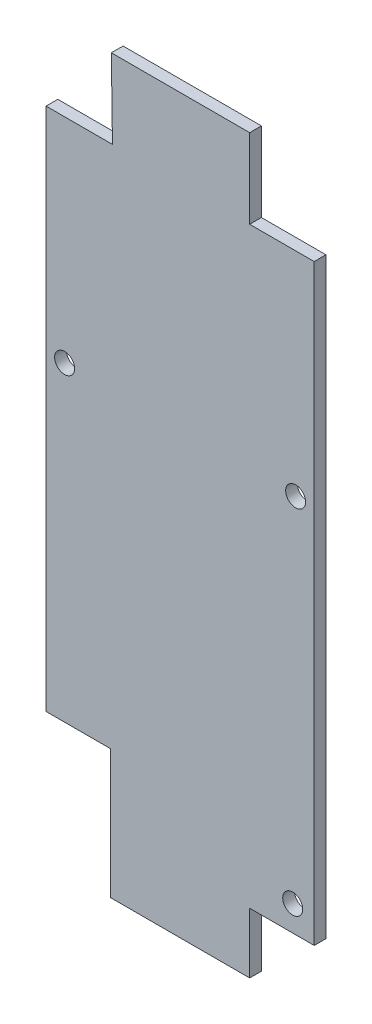
ISO-10303-21;
HEADER;
FILE_DESCRIPTION(('STEP AP214'),'2;1');
FILE_NAME('part.step','',(''),(''),'','','');
FILE_SCHEMA(('AUTOMOTIVE_DESIGN { 1 0 10303 214 1 1 1 1 }'));
ENDSEC;
DATA;
#1=APPLICATION_CONTEXT('core data for automotive mechanical design processes');
#2=APPLICATION_PROTOCOL_DEFINITION('international standard','automotive_design',2000,#1);
#3=PRODUCT_CONTEXT('',#1,'mechanical');
#4=PRODUCT('Part','Part','',(#3));
#5=PRODUCT_RELATED_PRODUCT_CATEGORY('part','',(#4));
#6=PRODUCT_DEFINITION_FORMATION('','',#4);
#7=PRODUCT_DEFINITION_CONTEXT('part definition',#1,'design');
#8=PRODUCT_DEFINITION('design','',#6,#7);
#9=PRODUCT_DEFINITION_SHAPE('','',#8);
#10=(LENGTH_UNIT() NAMED_UNIT(*) SI_UNIT(.MILLI.,.METRE.));
#11=(NAMED_UNIT(*) PLANE_ANGLE_UNIT() SI_UNIT($,.RADIAN.));
#12=(NAMED_UNIT(*) SI_UNIT($,.STERADIAN.) SOLID_ANGLE_UNIT());
#13=UNCERTAINTY_MEASURE_WITH_UNIT(LENGTH_MEASURE(1.E-05),#10,'distance_accuracy_value','');
#14=(GEOMETRIC_REPRESENTATION_CONTEXT(3) GLOBAL_UNCERTAINTY_ASSIGNED_CONTEXT((#13)) GLOBAL_UNIT_ASSIGNED_CONTEXT((#10,
#11,#12)) REPRESENTATION_CONTEXT('',''));
#15=CARTESIAN_POINT('',(0.,0.,0.));
#16=DIRECTION('',(0.,0.,1.));
#17=DIRECTION('',(1.,0.,0.));
#18=AXIS2_PLACEMENT_3D('',#15,#16,#17);
#19=CARTESIAN_POINT('',(5.44830000000197,-27.4129499999973,1.58750000000001));
#20=DIRECTION('',(0.,-1.,0.));
#21=DIRECTION('',(0.,0.,-1.));
#22=AXIS2_PLACEMENT_3D('',#19,#20,#21);
#23=PLANE('',#22);
#24=DIRECTION('',(-1.,0.,0.));
#25=VECTOR('',#24,1.);
#26=CARTESIAN_POINT('',(5.44830000000197,-27.4129499999973,0.));
#27=LINE('',#26,#25);
#28=CARTESIAN_POINT('',(5.44830000000197,-27.4129499999973,0.));
#29=VERTEX_POINT('',#28);
#30=CARTESIAN_POINT('',(-3.28295000000341,-27.4129499999973,0.));
#31=VERTEX_POINT('',#30);
#32=EDGE_CURVE('E130',#29,#31,#27,.T.);
#33=ORIENTED_EDGE('',*,*,#32,.T.);
#34=DIRECTION('',(0.,0.,-1.));
#35=VECTOR('',#34,1.);
#36=CARTESIAN_POINT('',(-3.28295000000341,-27.4129499999973,1.58749999999998));
#37=LINE('',#36,#35);
#38=CARTESIAN_POINT('',(-3.28295000000341,-27.4129499999973,1.58749999999998));
#39=VERTEX_POINT('',#38);
#40=EDGE_CURVE('E11',#39,#31,#37,.T.);
#41=ORIENTED_EDGE('',*,*,#40,.F.);
#42=DIRECTION('',(-1.,0.,0.));
#43=VECTOR('',#42,1.);
#44=CARTESIAN_POINT('',(5.44830000000197,-27.4129499999973,1.58750000000001));
#45=LINE('',#44,#43);
#46=CARTESIAN_POINT('',(5.44830000000197,-27.4129499999973,1.58750000000001));
#47=VERTEX_POINT('',#46);
#48=EDGE_CURVE('E134',#47,#39,#45,.T.);
#49=ORIENTED_EDGE('',*,*,#48,.F.);
#50=DIRECTION('',(0.,0.,-1.));
#51=VECTOR('',#50,1.);
#52=CARTESIAN_POINT('',(5.44830000000197,-27.4129499999973,1.58750000000001));
#53=LINE('',#52,#51);
#54=EDGE_CURVE('E174',#47,#29,#53,.T.);
#55=ORIENTED_EDGE('',*,*,#54,.T.);
#56=EDGE_LOOP('',(#33,#41,#49,#55));
#57=FACE_BOUND('',#56,.T.);
#58=ADVANCED_FACE('F36',(#57),#23,.F.);
#59=CARTESIAN_POINT('',(-3.28295000000341,-27.4129499999973,1.58749999999998));
#60=DIRECTION('',(-1.,0.,0.));
#61=DIRECTION('',(0.,0.,1.));
#62=AXIS2_PLACEMENT_3D('',#59,#60,#61);
#63=PLANE('',#62);
#64=DIRECTION('',(0.,1.,0.));
#65=VECTOR('',#64,1.);
#66=CARTESIAN_POINT('',(-3.28295000000341,-27.4129499999973,0.));
#67=LINE('',#66,#65);
#68=CARTESIAN_POINT('',(-3.28295000000341,-16.6687499999973,0.));
#69=VERTEX_POINT('',#68);
#70=EDGE_CURVE('E176',#31,#69,#67,.T.);
#71=ORIENTED_EDGE('',*,*,#70,.T.);
#72=DIRECTION('',(0.,0.,-1.));
#73=VECTOR('',#72,1.);
#74=CARTESIAN_POINT('',(-3.28295000000341,-16.6687499999973,1.58749999999998));
#75=LINE('',#74,#73);
#76=CARTESIAN_POINT('',(-3.28295000000341,-16.6687499999973,1.58749999999998));
#77=VERTEX_POINT('',#76);
#78=EDGE_CURVE('E43',#77,#69,#75,.T.);
#79=ORIENTED_EDGE('',*,*,#78,.F.);
#80=DIRECTION('',(0.,1.,0.));
#81=VECTOR('',#80,1.);
#82=CARTESIAN_POINT('',(-3.28295000000341,-27.4129499999973,1.58749999999998));
#83=LINE('',#82,#81);
#84=EDGE_CURVE('E155',#39,#77,#83,.T.);
#85=ORIENTED_EDGE('',*,*,#84,.F.);
#86=ORIENTED_EDGE('',*,*,#40,.T.);
#87=EDGE_LOOP('',(#71,#79,#85,#86));
#88=FACE_BOUND('',#87,.T.);
#89=ADVANCED_FACE('F238',(#88),#63,.F.);
#90=CARTESIAN_POINT('',(-3.28295000000341,-16.6687499999973,1.58749999999998));
#91=DIRECTION('',(0.,-1.,0.));
#92=DIRECTION('',(1.,0.,0.));
#93=AXIS2_PLACEMENT_3D('',#90,#91,#92);
#94=PLANE('',#93);
#95=DIRECTION('',(-1.,0.,0.));
#96=VECTOR('',#95,1.);
#97=CARTESIAN_POINT('',(-3.28295000000341,-16.6687499999973,0.));
#98=LINE('',#97,#96);
#99=CARTESIAN_POINT('',(-22.014883705053,-16.6687499999973,0.));
#100=VERTEX_POINT('',#99);
#101=EDGE_CURVE('E178',#69,#100,#98,.T.);
#102=ORIENTED_EDGE('',*,*,#101,.T.);
#103=DIRECTION('',(0.,0.,-1.));
#104=VECTOR('',#103,1.);
#105=CARTESIAN_POINT('',(-22.0148837050529,-16.6687499999973,1.58750000000001));
#106=LINE('',#105,#104);
#107=CARTESIAN_POINT('',(-22.0148837050529,-16.6687499999973,1.58750000000001));
#108=VERTEX_POINT('',#107);
#109=EDGE_CURVE('E212',#108,#100,#106,.T.);
#110=ORIENTED_EDGE('',*,*,#109,.F.);
#111=DIRECTION('',(-1.,0.,0.));
#112=VECTOR('',#111,1.);
#113=CARTESIAN_POINT('',(-3.28295000000341,-16.6687499999973,1.58749999999998));
#114=LINE('',#113,#112);
#115=EDGE_CURVE('E157',#77,#108,#114,.T.);
#116=ORIENTED_EDGE('',*,*,#115,.F.);
#117=ORIENTED_EDGE('',*,*,#78,.T.);
#118=EDGE_LOOP('',(#102,#110,#116,#117));
#119=FACE_BOUND('',#118,.T.);
#120=ADVANCED_FACE('F219',(#119),#94,.F.);
#121=CARTESIAN_POINT('',(-22.0148837050529,-16.6687499999973,1.58750000000001));
#122=DIRECTION('',(0.999897552567853,0.0143137824776339,0.));
#123=DIRECTION('',(-0.0143137824776341,0.999897552567853,0.));
#124=AXIS2_PLACEMENT_3D('',#121,#122,#123);
#125=PLANE('',#124);
#126=DIRECTION('',(0.0143137824776341,-0.999897552567853,0.));
#127=VECTOR('',#126,1.);
#128=CARTESIAN_POINT('',(-22.014883705053,-16.6687499999973,0.));
#129=LINE('',#128,#127);
#130=CARTESIAN_POINT('',(-21.8621686283145,-27.3367499999675,0.));
#131=VERTEX_POINT('',#130);
#132=EDGE_CURVE('E180',#100,#131,#129,.T.);
#133=ORIENTED_EDGE('',*,*,#132,.T.);
#134=DIRECTION('',(0.,0.,-1.));
#135=VECTOR('',#134,1.);
#136=CARTESIAN_POINT('',(-21.8621686283145,-27.3367499999675,1.58750000000003));
#137=LINE('',#136,#135);
#138=CARTESIAN_POINT('',(-21.8621686283145,-27.3367499999675,1.58750000000003));
#139=VERTEX_POINT('',#138);
#140=EDGE_CURVE('E209',#139,#131,#137,.T.);
#141=ORIENTED_EDGE('',*,*,#140,.F.);
#142=DIRECTION('',(0.0143137824776341,-0.999897552567853,0.));
#143=VECTOR('',#142,1.);
#144=CARTESIAN_POINT('',(-22.0148837050529,-16.6687499999973,1.58750000000001));
#145=LINE('',#144,#143);
#146=EDGE_CURVE('E159',#108,#139,#145,.T.);
#147=ORIENTED_EDGE('',*,*,#146,.F.);
#148=ORIENTED_EDGE('',*,*,#109,.T.);
#149=EDGE_LOOP('',(#133,#141,#147,#148));
#150=FACE_BOUND('',#149,.T.);
#151=ADVANCED_FACE('F226',(#150),#125,.F.);
#152=CARTESIAN_POINT('',(-21.8621686283145,-27.3367499999675,1.58750000000003));
#153=DIRECTION('',(0.,-1.,0.));
#154=DIRECTION('',(0.,0.,-1.));
#155=AXIS2_PLACEMENT_3D('',#152,#153,#154);
#156=PLANE('',#155);
#157=DIRECTION('',(-1.,0.,0.));
#158=VECTOR('',#157,1.);
#159=CARTESIAN_POINT('',(-21.8621686283145,-27.3367499999675,0.));
#160=LINE('',#159,#158);
#161=CARTESIAN_POINT('',(-30.8483000000033,-27.3367499999675,0.));
#162=VERTEX_POINT('',#161);
#163=EDGE_CURVE('E182',#131,#162,#160,.T.);
#164=ORIENTED_EDGE('',*,*,#163,.T.);
#165=DIRECTION('',(0.,0.,-1.));
#166=VECTOR('',#165,1.);
#167=CARTESIAN_POINT('',(-30.8483000000033,-27.3367499999675,1.58749999999998));
#168=LINE('',#167,#166);
#169=CARTESIAN_POINT('',(-30.8483000000033,-27.3367499999675,1.58749999999998));
#170=VERTEX_POINT('',#169);
#171=EDGE_CURVE('E206',#170,#162,#168,.T.);
#172=ORIENTED_EDGE('',*,*,#171,.F.);
#173=DIRECTION('',(-1.,0.,0.));
#174=VECTOR('',#173,1.);
#175=CARTESIAN_POINT('',(-21.8621686283145,-27.3367499999675,1.58750000000003));
#176=LINE('',#175,#174);
#177=EDGE_CURVE('E161',#139,#170,#176,.T.);
#178=ORIENTED_EDGE('',*,*,#177,.F.);
#179=ORIENTED_EDGE('',*,*,#140,.T.);
#180=EDGE_LOOP('',(#164,#172,#178,#179));
#181=FACE_BOUND('',#180,.T.);
#182=ADVANCED_FACE('F230',(#181),#156,.F.);
#183=CARTESIAN_POINT('',(-30.8483000000033,-49.6887499999971,1.58749999999998));
#184=DIRECTION('',(1.,0.,0.));
#185=DIRECTION('',(0.,0.,-1.));
#186=AXIS2_PLACEMENT_3D('',#183,#184,#185);
#187=PLANE('',#186);
#188=DIRECTION('',(0.,-1.,0.));
#189=VECTOR('',#188,1.);
#190=CARTESIAN_POINT('',(-30.8483000000033,-49.6887499999971,0.));
#191=LINE('',#190,#189);
#192=CARTESIAN_POINT('',(-30.8483000000033,-98.317049999997,0.));
#193=VERTEX_POINT('',#192);
#194=EDGE_CURVE('E185',#162,#193,#191,.T.);
#195=ORIENTED_EDGE('',*,*,#194,.T.);
#196=DIRECTION('',(0.,0.,-1.));
#197=VECTOR('',#196,1.);
#198=CARTESIAN_POINT('',(-30.8483000000033,-98.3170499999971,1.58750000000001));
#199=LINE('',#198,#197);
#200=CARTESIAN_POINT('',(-30.8483000000033,-98.3170499999971,1.58750000000001));
#201=VERTEX_POINT('',#200);
#202=EDGE_CURVE('E203',#201,#193,#199,.T.);
#203=ORIENTED_EDGE('',*,*,#202,.F.);
#204=DIRECTION('',(0.,-1.,0.));
#205=VECTOR('',#204,1.);
#206=CARTESIAN_POINT('',(-30.8483000000033,-27.3367499999675,1.58749999999998));
#207=LINE('',#206,#205);
#208=EDGE_CURVE('E163',#170,#201,#207,.T.);
#209=ORIENTED_EDGE('',*,*,#208,.F.);
#210=ORIENTED_EDGE('',*,*,#171,.T.);
#211=EDGE_LOOP('',(#195,#203,#209,#210));
#212=FACE_BOUND('',#211,.T.);
#213=ADVANCED_FACE('F253',(#212),#187,.F.);
#214=CARTESIAN_POINT('',(-30.8483000000033,-98.3170499999971,1.58750000000001));
#215=DIRECTION('',(0.,1.,0.));
#216=DIRECTION('',(-1.,0.,0.));
#217=AXIS2_PLACEMENT_3D('',#214,#215,#216);
#218=PLANE('',#217);
#219=DIRECTION('',(1.,0.,0.));
#220=VECTOR('',#219,1.);
#221=CARTESIAN_POINT('',(-30.8483000000033,-98.317049999997,0.));
#222=LINE('',#221,#220);
#223=CARTESIAN_POINT('',(-22.1170500000013,-98.3170499999971,0.));
#224=VERTEX_POINT('',#223);
#225=EDGE_CURVE('E187',#193,#224,#222,.T.);
#226=ORIENTED_EDGE('',*,*,#225,.T.);
#227=DIRECTION('',(0.,0.,-1.));
#228=VECTOR('',#227,1.);
#229=CARTESIAN_POINT('',(-22.1170500000013,-98.317049999997,1.58750000000001));
#230=LINE('',#229,#228);
#231=CARTESIAN_POINT('',(-22.1170500000013,-98.317049999997,1.58750000000001));
#232=VERTEX_POINT('',#231);
#233=EDGE_CURVE('E200',#232,#224,#230,.T.);
#234=ORIENTED_EDGE('',*,*,#233,.F.);
#235=DIRECTION('',(1.,0.,0.));
#236=VECTOR('',#235,1.);
#237=CARTESIAN_POINT('',(-30.8483000000033,-98.3170499999971,1.58750000000001));
#238=LINE('',#237,#236);
#239=EDGE_CURVE('E165',#201,#232,#238,.T.);
#240=ORIENTED_EDGE('',*,*,#239,.F.);
#241=ORIENTED_EDGE('',*,*,#202,.T.);
#242=EDGE_LOOP('',(#226,#234,#240,#241));
#243=FACE_BOUND('',#242,.T.);
#244=ADVANCED_FACE('F256',(#243),#218,.F.);
#245=CARTESIAN_POINT('',(-22.1170500000013,-98.317049999997,1.58750000000001));
#246=DIRECTION('',(1.,0.,0.));
#247=DIRECTION('',(0.,0.,-1.));
#248=AXIS2_PLACEMENT_3D('',#245,#246,#247);
#249=PLANE('',#248);
#250=DIRECTION('',(0.,-1.,0.));
#251=VECTOR('',#250,1.);
#252=CARTESIAN_POINT('',(-22.1170500000013,-98.3170499999971,0.));
#253=LINE('',#252,#251);
#254=CARTESIAN_POINT('',(-22.1170500000013,-115.779549999998,0.));
#255=VERTEX_POINT('',#254);
#256=EDGE_CURVE('E189',#224,#255,#253,.T.);
#257=ORIENTED_EDGE('',*,*,#256,.T.);
#258=DIRECTION('',(0.,0.,-1.));
#259=VECTOR('',#258,1.);
#260=CARTESIAN_POINT('',(-22.1170500000013,-115.779549999998,1.58750000000001));
#261=LINE('',#260,#259);
#262=CARTESIAN_POINT('',(-22.1170500000013,-115.779549999998,1.58750000000001));
#263=VERTEX_POINT('',#262);
#264=EDGE_CURVE('E197',#263,#255,#261,.T.);
#265=ORIENTED_EDGE('',*,*,#264,.F.);
#266=DIRECTION('',(0.,-1.,0.));
#267=VECTOR('',#266,1.);
#268=CARTESIAN_POINT('',(-22.1170500000013,-98.317049999997,1.58750000000001));
#269=LINE('',#268,#267);
#270=EDGE_CURVE('E167',#232,#263,#269,.T.);
#271=ORIENTED_EDGE('',*,*,#270,.F.);
#272=ORIENTED_EDGE('',*,*,#233,.T.);
#273=EDGE_LOOP('',(#257,#265,#271,#272));
#274=FACE_BOUND('',#273,.T.);
#275=ADVANCED_FACE('F260',(#274),#249,.F.);
#276=CARTESIAN_POINT('',(-22.1170500000013,-115.779549999998,1.58750000000001));
#277=DIRECTION('',(0.,1.,0.));
#278=DIRECTION('',(0.,0.,1.));
#279=AXIS2_PLACEMENT_3D('',#276,#277,#278);
#280=PLANE('',#279);
#281=DIRECTION('',(1.,0.,0.));
#282=VECTOR('',#281,1.);
#283=CARTESIAN_POINT('',(-22.1170500000013,-115.779549999998,0.));
#284=LINE('',#283,#282);
#285=CARTESIAN_POINT('',(-3.28295000000123,-115.779549999998,0.));
#286=VERTEX_POINT('',#285);
#287=EDGE_CURVE('E191',#255,#286,#284,.T.);
#288=ORIENTED_EDGE('',*,*,#287,.T.);
#289=DIRECTION('',(0.,0.,-1.));
#290=VECTOR('',#289,1.);
#291=CARTESIAN_POINT('',(-3.28295000000124,-115.779549999998,1.58750000000001));
#292=LINE('',#291,#290);
#293=CARTESIAN_POINT('',(-3.28295000000124,-115.779549999998,1.58750000000001));
#294=VERTEX_POINT('',#293);
#295=EDGE_CURVE('E195',#294,#286,#292,.T.);
#296=ORIENTED_EDGE('',*,*,#295,.F.);
#297=DIRECTION('',(1.,0.,0.));
#298=VECTOR('',#297,1.);
#299=CARTESIAN_POINT('',(-22.1170500000013,-115.779549999998,1.58750000000001));
#300=LINE('',#299,#298);
#301=EDGE_CURVE('E169',#263,#294,#300,.T.);
#302=ORIENTED_EDGE('',*,*,#301,.F.);
#303=ORIENTED_EDGE('',*,*,#264,.T.);
#304=EDGE_LOOP('',(#288,#296,#302,#303));
#305=FACE_BOUND('',#304,.T.);
#306=ADVANCED_FACE('F264',(#305),#280,.F.);
#307=CARTESIAN_POINT('',(-3.28295000000124,-115.779549999998,1.58750000000001));
#308=DIRECTION('',(-1.,0.,0.));
#309=DIRECTION('',(0.,-1.,0.));
#310=AXIS2_PLACEMENT_3D('',#307,#308,#309);
#311=PLANE('',#310);
#312=DIRECTION('',(0.,1.,0.));
#313=VECTOR('',#312,1.);
#314=CARTESIAN_POINT('',(-3.28295000000123,-115.779549999998,0.));
#315=LINE('',#314,#313);
#316=CARTESIAN_POINT('',(-3.28295000000124,-107.600749999996,0.));
#317=VERTEX_POINT('',#316);
#318=EDGE_CURVE('E55',#286,#317,#315,.T.);
#319=ORIENTED_EDGE('',*,*,#318,.T.);
#320=DIRECTION('',(0.,0.,1.));
#321=VECTOR('',#320,1.);
#322=CARTESIAN_POINT('',(-3.28295000000124,-107.600749999996,0.));
#323=LINE('',#322,#321);
#324=CARTESIAN_POINT('',(-3.28295000000124,-107.600749999996,1.58750000000002));
#325=VERTEX_POINT('',#324);
#326=EDGE_CURVE('E50',#317,#325,#323,.T.);
#327=ORIENTED_EDGE('',*,*,#326,.T.);
#328=DIRECTION('',(0.,1.,0.));
#329=VECTOR('',#328,1.);
#330=CARTESIAN_POINT('',(-3.28295000000124,-115.779549999998,1.58750000000001));
#331=LINE('',#330,#329);
#332=EDGE_CURVE('E171',#294,#325,#331,.T.);
#333=ORIENTED_EDGE('',*,*,#332,.F.);
#334=ORIENTED_EDGE('',*,*,#295,.T.);
#335=EDGE_LOOP('',(#319,#327,#333,#334));
#336=FACE_BOUND('',#335,.T.);
#337=ADVANCED_FACE('F268',(#336),#311,.F.);
#338=CARTESIAN_POINT('',(5.44830000000199,-49.6887499999972,1.58749999999998));
#339=DIRECTION('',(-1.,0.,0.));
#340=DIRECTION('',(0.,0.,1.));
#341=AXIS2_PLACEMENT_3D('',#338,#339,#340);
#342=PLANE('',#341);
#343=DIRECTION('',(0.,1.,0.));
#344=VECTOR('',#343,1.);
#345=CARTESIAN_POINT('',(5.44830000000197,-49.6887499999972,0.));
#346=LINE('',#345,#344);
#347=CARTESIAN_POINT('',(5.44830000000199,-107.600749999996,0.));
#348=VERTEX_POINT('',#347);
#349=EDGE_CURVE('E124',#348,#29,#346,.T.);
#350=ORIENTED_EDGE('',*,*,#349,.T.);
#351=ORIENTED_EDGE('',*,*,#54,.F.);
#352=DIRECTION('',(0.,1.,0.));
#353=VECTOR('',#352,1.);
#354=CARTESIAN_POINT('',(5.44830000000198,-98.3170499999967,1.58750000000001));
#355=LINE('',#354,#353);
#356=CARTESIAN_POINT('',(5.44830000000197,-107.600749999996,1.58749999999999));
#357=VERTEX_POINT('',#356);
#358=EDGE_CURVE('E139',#357,#47,#355,.T.);
#359=ORIENTED_EDGE('',*,*,#358,.F.);
#360=DIRECTION('',(0.,0.,1.));
#361=VECTOR('',#360,1.);
#362=CARTESIAN_POINT('',(5.44830000000199,-107.600749999996,0.));
#363=LINE('',#362,#361);
#364=EDGE_CURVE('E137',#348,#357,#363,.T.);
#365=ORIENTED_EDGE('',*,*,#364,.F.);
#366=EDGE_LOOP('',(#350,#351,#359,#365));
#367=FACE_BOUND('',#366,.T.);
#368=ADVANCED_FACE('F138',(#367),#342,.F.);
#369=CARTESIAN_POINT('',(0.,0.,1.58749999999999));
#370=DIRECTION('',(0.,0.,-1.));
#371=DIRECTION('',(-1.,0.,0.));
#372=AXIS2_PLACEMENT_3D('',#369,#370,#371);
#373=PLANE('',#372);
#374=CARTESIAN_POINT('',(2.53999999999974,-104.139999999996,1.58749999999998));
#375=DIRECTION('',(0.,0.,1.));
#376=DIRECTION('',(1.,0.,0.));
#377=AXIS2_PLACEMENT_3D('',#374,#375,#376);
#378=CIRCLE('',#377,1.35255);
#379=CARTESIAN_POINT('',(3.89254999999974,-104.139999999996,1.58749999999998));
#380=VERTEX_POINT('',#379);
#381=EDGE_CURVE('E301',#380,#380,#378,.T.);
#382=ORIENTED_EDGE('',*,*,#381,.F.);
#383=EDGE_LOOP('',(#382));
#384=FACE_BOUND('',#383,.T.);
#385=CARTESIAN_POINT('',(-28.3368749999995,-56.1974999999967,1.58750000000001));
#386=DIRECTION('',(0.,0.,1.));
#387=DIRECTION('',(1.,0.,0.));
#388=AXIS2_PLACEMENT_3D('',#385,#386,#387);
#389=CIRCLE('',#388,1.35255);
#390=CARTESIAN_POINT('',(-26.9843249999995,-56.1974999999967,1.58750000000001));
#391=VERTEX_POINT('',#390);
#392=EDGE_CURVE('E303',#391,#391,#389,.T.);
#393=ORIENTED_EDGE('',*,*,#392,.F.);
#394=EDGE_LOOP('',(#393));
#395=FACE_BOUND('',#394,.T.);
#396=CARTESIAN_POINT('',(2.93687500000007,-56.1974999999967,1.58750000000003));
#397=DIRECTION('',(0.,0.,1.));
#398=DIRECTION('',(1.,0.,0.));
#399=AXIS2_PLACEMENT_3D('',#396,#397,#398);
#400=CIRCLE('',#399,1.35255);
#401=CARTESIAN_POINT('',(4.28942500000008,-56.1974999999967,1.58750000000003));
#402=VERTEX_POINT('',#401);
#403=EDGE_CURVE('E310',#402,#402,#400,.T.);
#404=ORIENTED_EDGE('',*,*,#403,.F.);
#405=EDGE_LOOP('',(#404));
#406=FACE_BOUND('',#405,.T.);
#407=ORIENTED_EDGE('',*,*,#332,.T.);
#408=DIRECTION('',(1.,0.,0.));
#409=VECTOR('',#408,1.);
#410=CARTESIAN_POINT('',(-3.28295000000124,-107.600749999996,1.58750000000002));
#411=LINE('',#410,#409);
#412=EDGE_CURVE('E145',#325,#357,#411,.T.);
#413=ORIENTED_EDGE('',*,*,#412,.T.);
#414=ORIENTED_EDGE('',*,*,#358,.T.);
#415=ORIENTED_EDGE('',*,*,#48,.T.);
#416=ORIENTED_EDGE('',*,*,#84,.T.);
#417=ORIENTED_EDGE('',*,*,#115,.T.);
#418=ORIENTED_EDGE('',*,*,#146,.T.);
#419=ORIENTED_EDGE('',*,*,#177,.T.);
#420=ORIENTED_EDGE('',*,*,#208,.T.);
#421=ORIENTED_EDGE('',*,*,#239,.T.);
#422=ORIENTED_EDGE('',*,*,#270,.T.);
#423=ORIENTED_EDGE('',*,*,#301,.T.);
#424=EDGE_LOOP('',(#407,#413,#414,#415,#416,#417,#418,#419,#420,#421,#422,#423));
#425=FACE_BOUND('',#424,.T.);
#426=ADVANCED_FACE('F234',(#384,#395,#406,#425),#373,.F.);
#427=CARTESIAN_POINT('',(0.,0.,0.));
#428=DIRECTION('',(0.,0.,-1.));
#429=DIRECTION('',(-1.,0.,0.));
#430=AXIS2_PLACEMENT_3D('',#427,#428,#429);
#431=PLANE('',#430);
#432=CARTESIAN_POINT('',(2.53999999999975,-104.139999999996,0.));
#433=DIRECTION('',(0.,0.,1.));
#434=DIRECTION('',(1.,0.,0.));
#435=AXIS2_PLACEMENT_3D('',#432,#433,#434);
#436=CIRCLE('',#435,1.35255);
#437=CARTESIAN_POINT('',(3.89254999999975,-104.139999999996,0.));
#438=VERTEX_POINT('',#437);
#439=EDGE_CURVE('E298',#438,#438,#436,.T.);
#440=ORIENTED_EDGE('',*,*,#439,.T.);
#441=EDGE_LOOP('',(#440));
#442=FACE_BOUND('',#441,.T.);
#443=CARTESIAN_POINT('',(-28.3368749999995,-56.1974999999967,0.));
#444=DIRECTION('',(0.,0.,1.));
#445=DIRECTION('',(1.,0.,0.));
#446=AXIS2_PLACEMENT_3D('',#443,#444,#445);
#447=CIRCLE('',#446,1.35255);
#448=CARTESIAN_POINT('',(-26.9843249999995,-56.1974999999967,0.));
#449=VERTEX_POINT('',#448);
#450=EDGE_CURVE('E308',#449,#449,#447,.T.);
#451=ORIENTED_EDGE('',*,*,#450,.T.);
#452=EDGE_LOOP('',(#451));
#453=FACE_BOUND('',#452,.T.);
#454=CARTESIAN_POINT('',(2.93687500000009,-56.1974999999968,0.));
#455=DIRECTION('',(0.,0.,1.));
#456=DIRECTION('',(1.,0.,0.));
#457=AXIS2_PLACEMENT_3D('',#454,#455,#456);
#458=CIRCLE('',#457,1.35255);
#459=CARTESIAN_POINT('',(4.28942500000009,-56.1974999999968,0.));
#460=VERTEX_POINT('',#459);
#461=EDGE_CURVE('E148',#460,#460,#458,.T.);
#462=ORIENTED_EDGE('',*,*,#461,.T.);
#463=EDGE_LOOP('',(#462));
#464=FACE_BOUND('',#463,.T.);
#465=DIRECTION('',(1.,0.,0.));
#466=VECTOR('',#465,1.);
#467=CARTESIAN_POINT('',(-3.28295000000124,-107.600749999996,0.));
#468=LINE('',#467,#466);
#469=EDGE_CURVE('E128',#317,#348,#468,.T.);
#470=ORIENTED_EDGE('',*,*,#469,.F.);
#471=ORIENTED_EDGE('',*,*,#318,.F.);
#472=ORIENTED_EDGE('',*,*,#287,.F.);
#473=ORIENTED_EDGE('',*,*,#256,.F.);
#474=ORIENTED_EDGE('',*,*,#225,.F.);
#475=ORIENTED_EDGE('',*,*,#194,.F.);
#476=ORIENTED_EDGE('',*,*,#163,.F.);
#477=ORIENTED_EDGE('',*,*,#132,.F.);
#478=ORIENTED_EDGE('',*,*,#101,.F.);
#479=ORIENTED_EDGE('',*,*,#70,.F.);
#480=ORIENTED_EDGE('',*,*,#32,.F.);
#481=ORIENTED_EDGE('',*,*,#349,.F.);
#482=EDGE_LOOP('',(#470,#471,#472,#473,#474,#475,#476,#477,#478,#479,#480,#481));
#483=FACE_BOUND('',#482,.T.);
#484=ADVANCED_FACE('F126',(#442,#453,#464,#483),#431,.T.);
#485=CARTESIAN_POINT('',(-3.28295000000124,-107.600749999996,0.));
#486=DIRECTION('',(0.,-1.,0.));
#487=DIRECTION('',(0.,0.,-1.));
#488=AXIS2_PLACEMENT_3D('',#485,#486,#487);
#489=PLANE('',#488);
#490=ORIENTED_EDGE('',*,*,#412,.F.);
#491=ORIENTED_EDGE('',*,*,#326,.F.);
#492=ORIENTED_EDGE('',*,*,#469,.T.);
#493=ORIENTED_EDGE('',*,*,#364,.T.);
#494=EDGE_LOOP('',(#490,#491,#492,#493));
#495=FACE_BOUND('',#494,.T.);
#496=ADVANCED_FACE('F144',(#495),#489,.T.);
#497=CARTESIAN_POINT('',(2.93687500000007,-56.1974999999967,1.58750000000003));
#498=DIRECTION('',(0.,0.,1.));
#499=DIRECTION('',(1.,0.,0.));
#500=AXIS2_PLACEMENT_3D('',#497,#498,#499);
#501=CYLINDRICAL_SURFACE('',#500,1.35255);
#502=ORIENTED_EDGE('',*,*,#461,.F.);
#503=EDGE_LOOP('',(#502));
#504=FACE_BOUND('',#503,.T.);
#505=ORIENTED_EDGE('',*,*,#403,.T.);
#506=EDGE_LOOP('',(#505));
#507=FACE_BOUND('',#506,.T.);
#508=ADVANCED_FACE('F282',(#504,#507),#501,.F.);
#509=CARTESIAN_POINT('',(-28.3368749999995,-56.1974999999967,1.58750000000001));
#510=DIRECTION('',(0.,0.,1.));
#511=DIRECTION('',(1.,0.,0.));
#512=AXIS2_PLACEMENT_3D('',#509,#510,#511);
#513=CYLINDRICAL_SURFACE('',#512,1.35255);
#514=ORIENTED_EDGE('',*,*,#450,.F.);
#515=EDGE_LOOP('',(#514));
#516=FACE_BOUND('',#515,.T.);
#517=ORIENTED_EDGE('',*,*,#392,.T.);
#518=EDGE_LOOP('',(#517));
#519=FACE_BOUND('',#518,.T.);
#520=ADVANCED_FACE('F285',(#516,#519),#513,.F.);
#521=CARTESIAN_POINT('',(2.53999999999974,-104.139999999996,1.58749999999998));
#522=DIRECTION('',(0.,0.,1.));
#523=DIRECTION('',(1.,0.,0.));
#524=AXIS2_PLACEMENT_3D('',#521,#522,#523);
#525=CYLINDRICAL_SURFACE('',#524,1.35255);
#526=ORIENTED_EDGE('',*,*,#439,.F.);
#527=EDGE_LOOP('',(#526));
#528=FACE_BOUND('',#527,.T.);
#529=ORIENTED_EDGE('',*,*,#381,.T.);
#530=EDGE_LOOP('',(#529));
#531=FACE_BOUND('',#530,.T.);
#532=ADVANCED_FACE('F289',(#528,#531),#525,.F.);
#533=CLOSED_SHELL('',(#58,#89,#120,#151,#182,#213,#244,#275,#306,#337,#368,#426,#484,#496,#508,
#520,#532));
#534=MANIFOLD_SOLID_BREP('B2',#533);
#535=ADVANCED_BREP_SHAPE_REPRESENTATION('',(#18,#534),#14);
#536=SHAPE_DEFINITION_REPRESENTATION(#9,#535);
ENDSEC;
END-ISO-10303-21;
